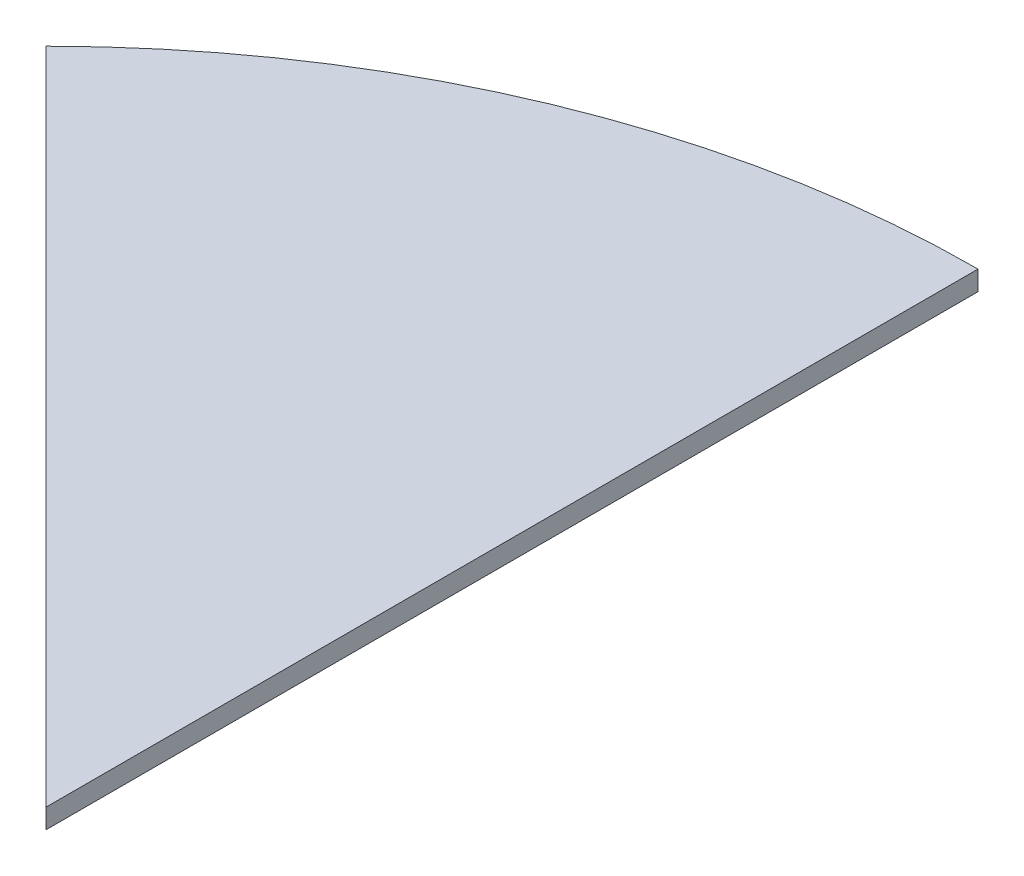
ISO-10303-21;
HEADER;
FILE_DESCRIPTION(('STEP AP214'),'2;1');
FILE_NAME('part.step','',(''),(''),'','','');
FILE_SCHEMA(('AUTOMOTIVE_DESIGN { 1 0 10303 214 1 1 1 1 }'));
ENDSEC;
DATA;
#1=APPLICATION_CONTEXT('core data for automotive mechanical design processes');
#2=APPLICATION_PROTOCOL_DEFINITION('international standard','automotive_design',2000,#1);
#3=PRODUCT_CONTEXT('',#1,'mechanical');
#4=PRODUCT('Part','Part','',(#3));
#5=PRODUCT_RELATED_PRODUCT_CATEGORY('part','',(#4));
#6=PRODUCT_DEFINITION_FORMATION('','',#4);
#7=PRODUCT_DEFINITION_CONTEXT('part definition',#1,'design');
#8=PRODUCT_DEFINITION('design','',#6,#7);
#9=PRODUCT_DEFINITION_SHAPE('','',#8);
#10=(LENGTH_UNIT() NAMED_UNIT(*) SI_UNIT(.MILLI.,.METRE.));
#11=(NAMED_UNIT(*) PLANE_ANGLE_UNIT() SI_UNIT($,.RADIAN.));
#12=(NAMED_UNIT(*) SI_UNIT($,.STERADIAN.) SOLID_ANGLE_UNIT());
#13=UNCERTAINTY_MEASURE_WITH_UNIT(LENGTH_MEASURE(1.E-05),#10,'distance_accuracy_value','');
#14=(GEOMETRIC_REPRESENTATION_CONTEXT(3) GLOBAL_UNCERTAINTY_ASSIGNED_CONTEXT((#13)) GLOBAL_UNIT_ASSIGNED_CONTEXT((#10,
#11,#12)) REPRESENTATION_CONTEXT('',''));
#15=CARTESIAN_POINT('',(0.,0.,0.));
#16=DIRECTION('',(0.,0.,1.));
#17=DIRECTION('',(1.,0.,0.));
#18=AXIS2_PLACEMENT_3D('',#15,#16,#17);
#19=CARTESIAN_POINT('',(0.,20.,0.));
#20=DIRECTION('',(0.707106781186548,0.,-0.707106781186548));
#21=DIRECTION('',(-0.707106781186548,0.,-0.707106781186548));
#22=AXIS2_PLACEMENT_3D('',#19,#20,#21);
#23=PLANE('',#22);
#24=DIRECTION('',(0.707106781186548,0.,0.707106781186548));
#25=VECTOR('',#24,1.);
#26=CARTESIAN_POINT('',(0.,0.,0.));
#27=LINE('',#26,#25);
#28=CARTESIAN_POINT('',(-671.75144212722,0.,-671.75144212722));
#29=VERTEX_POINT('',#28);
#30=CARTESIAN_POINT('',(0.,0.,0.));
#31=VERTEX_POINT('',#30);
#32=EDGE_CURVE('E77',#29,#31,#27,.T.);
#33=ORIENTED_EDGE('',*,*,#32,.T.);
#34=DIRECTION('',(0.,-1.,0.));
#35=VECTOR('',#34,1.);
#36=CARTESIAN_POINT('',(0.,20.,0.));
#37=LINE('',#36,#35);
#38=CARTESIAN_POINT('',(0.,20.,0.));
#39=VERTEX_POINT('',#38);
#40=EDGE_CURVE('E11',#39,#31,#37,.T.);
#41=ORIENTED_EDGE('',*,*,#40,.F.);
#42=DIRECTION('',(0.707106781186548,0.,0.707106781186548));
#43=VECTOR('',#42,1.);
#44=CARTESIAN_POINT('',(0.,20.,0.));
#45=LINE('',#44,#43);
#46=CARTESIAN_POINT('',(-671.75144212722,20.,-671.75144212722));
#47=VERTEX_POINT('',#46);
#48=EDGE_CURVE('E70',#47,#39,#45,.T.);
#49=ORIENTED_EDGE('',*,*,#48,.F.);
#50=DIRECTION('',(0.,-1.,0.));
#51=VECTOR('',#50,1.);
#52=CARTESIAN_POINT('',(-671.75144212722,20.,-671.75144212722));
#53=LINE('',#52,#51);
#54=EDGE_CURVE('E78',#47,#29,#53,.T.);
#55=ORIENTED_EDGE('',*,*,#54,.T.);
#56=EDGE_LOOP('',(#33,#41,#49,#55));
#57=FACE_BOUND('',#56,.T.);
#58=ADVANCED_FACE('F30',(#57),#23,.F.);
#59=CARTESIAN_POINT('',(0.,20.,-950.));
#60=DIRECTION('',(-1.,0.,0.));
#61=DIRECTION('',(0.,0.,1.));
#62=AXIS2_PLACEMENT_3D('',#59,#60,#61);
#63=PLANE('',#62);
#64=DIRECTION('',(0.,0.,-1.));
#65=VECTOR('',#64,1.);
#66=CARTESIAN_POINT('',(0.,0.,-950.));
#67=LINE('',#66,#65);
#68=CARTESIAN_POINT('',(0.,0.,-950.));
#69=VERTEX_POINT('',#68);
#70=EDGE_CURVE('E58',#31,#69,#67,.T.);
#71=ORIENTED_EDGE('',*,*,#70,.T.);
#72=DIRECTION('',(0.,-1.,0.));
#73=VECTOR('',#72,1.);
#74=CARTESIAN_POINT('',(0.,20.,-950.));
#75=LINE('',#74,#73);
#76=CARTESIAN_POINT('',(0.,20.,-950.));
#77=VERTEX_POINT('',#76);
#78=EDGE_CURVE('E38',#77,#69,#75,.T.);
#79=ORIENTED_EDGE('',*,*,#78,.F.);
#80=DIRECTION('',(0.,0.,-1.));
#81=VECTOR('',#80,1.);
#82=CARTESIAN_POINT('',(0.,20.,-950.));
#83=LINE('',#82,#81);
#84=EDGE_CURVE('E66',#39,#77,#83,.T.);
#85=ORIENTED_EDGE('',*,*,#84,.F.);
#86=ORIENTED_EDGE('',*,*,#40,.T.);
#87=EDGE_LOOP('',(#71,#79,#85,#86));
#88=FACE_BOUND('',#87,.T.);
#89=ADVANCED_FACE('F67',(#88),#63,.F.);
#90=CARTESIAN_POINT('',(0.,20.,0.));
#91=DIRECTION('',(0.,-1.,0.));
#92=DIRECTION('',(0.,0.,-1.));
#93=AXIS2_PLACEMENT_3D('',#90,#91,#92);
#94=CYLINDRICAL_SURFACE('',#93,950.);
#95=CARTESIAN_POINT('',(0.,0.,0.));
#96=DIRECTION('',(0.,1.,0.));
#97=DIRECTION('',(0.,0.,1.));
#98=AXIS2_PLACEMENT_3D('',#95,#96,#97);
#99=CIRCLE('',#98,950.);
#100=EDGE_CURVE('E63',#69,#29,#99,.T.);
#101=ORIENTED_EDGE('',*,*,#100,.T.);
#102=ORIENTED_EDGE('',*,*,#54,.F.);
#103=CARTESIAN_POINT('',(0.,20.,0.));
#104=DIRECTION('',(0.,1.,0.));
#105=DIRECTION('',(0.,0.,1.));
#106=AXIS2_PLACEMENT_3D('',#103,#104,#105);
#107=CIRCLE('',#106,950.);
#108=EDGE_CURVE('E46',#77,#47,#107,.T.);
#109=ORIENTED_EDGE('',*,*,#108,.F.);
#110=ORIENTED_EDGE('',*,*,#78,.T.);
#111=EDGE_LOOP('',(#101,#102,#109,#110));
#112=FACE_BOUND('',#111,.T.);
#113=ADVANCED_FACE('F85',(#112),#94,.T.);
#114=CARTESIAN_POINT('',(0.,20.,0.));
#115=DIRECTION('',(0.,1.,0.));
#116=DIRECTION('',(0.,0.,1.));
#117=AXIS2_PLACEMENT_3D('',#114,#115,#116);
#118=PLANE('',#117);
#119=ORIENTED_EDGE('',*,*,#48,.T.);
#120=ORIENTED_EDGE('',*,*,#84,.T.);
#121=ORIENTED_EDGE('',*,*,#108,.T.);
#122=EDGE_LOOP('',(#119,#120,#121));
#123=FACE_BOUND('',#122,.T.);
#124=ADVANCED_FACE('F73',(#123),#118,.T.);
#125=CARTESIAN_POINT('',(0.,0.,0.));
#126=DIRECTION('',(0.,1.,0.));
#127=DIRECTION('',(0.,0.,1.));
#128=AXIS2_PLACEMENT_3D('',#125,#126,#127);
#129=PLANE('',#128);
#130=ORIENTED_EDGE('',*,*,#32,.F.);
#131=ORIENTED_EDGE('',*,*,#100,.F.);
#132=ORIENTED_EDGE('',*,*,#70,.F.);
#133=EDGE_LOOP('',(#130,#131,#132));
#134=FACE_BOUND('',#133,.T.);
#135=ADVANCED_FACE('F86',(#134),#129,.F.);
#136=CLOSED_SHELL('',(#58,#89,#113,#124,#135));
#137=MANIFOLD_SOLID_BREP('B2',#136);
#138=ADVANCED_BREP_SHAPE_REPRESENTATION('',(#18,#137),#14);
#139=SHAPE_DEFINITION_REPRESENTATION(#9,#138);
ENDSEC;
END-ISO-10303-21;
